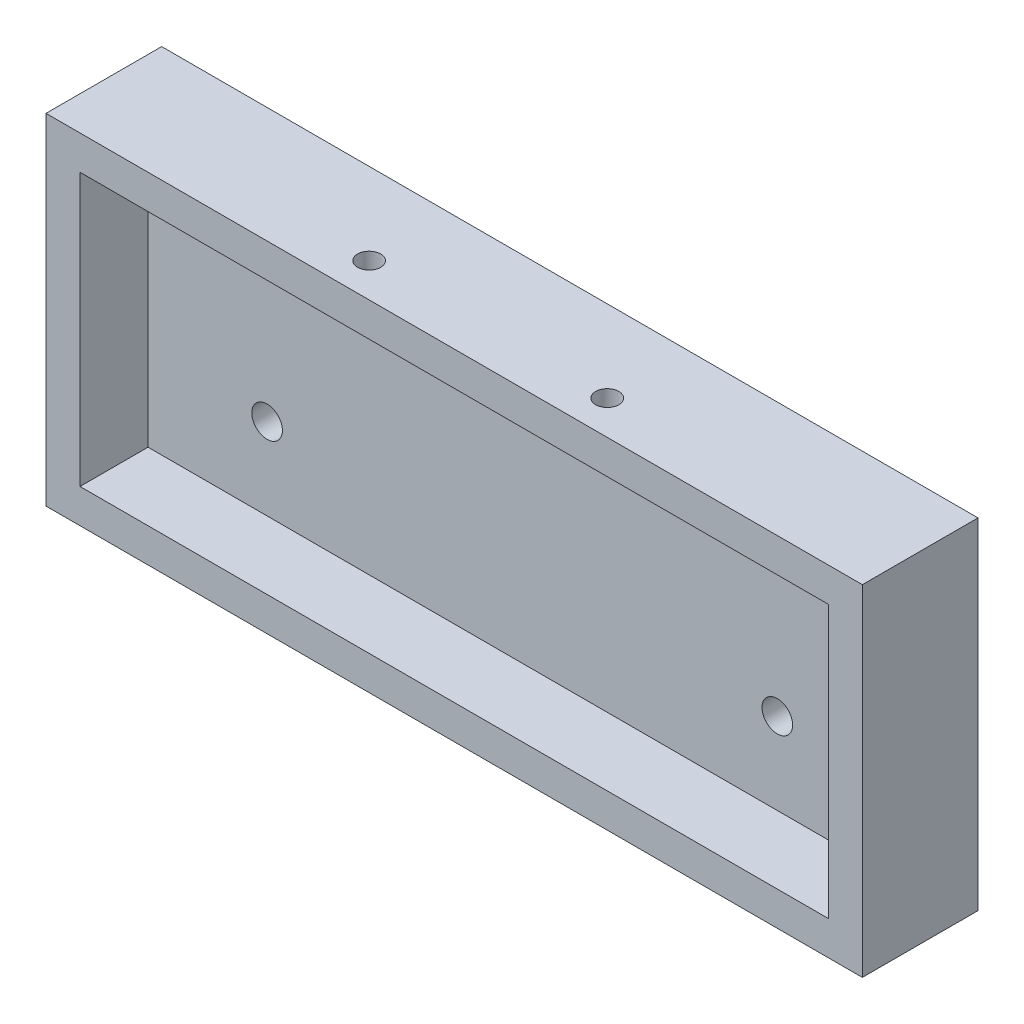
ISO-10303-21;
HEADER;
FILE_DESCRIPTION(('STEP AP214'),'2;1');
FILE_NAME('part.step','',(''),(''),'','','');
FILE_SCHEMA(('AUTOMOTIVE_DESIGN { 1 0 10303 214 1 1 1 1 }'));
ENDSEC;
DATA;
#1=APPLICATION_CONTEXT('core data for automotive mechanical design processes');
#2=APPLICATION_PROTOCOL_DEFINITION('international standard','automotive_design',2000,#1);
#3=PRODUCT_CONTEXT('',#1,'mechanical');
#4=PRODUCT('Part','Part','',(#3));
#5=PRODUCT_RELATED_PRODUCT_CATEGORY('part','',(#4));
#6=PRODUCT_DEFINITION_FORMATION('','',#4);
#7=PRODUCT_DEFINITION_CONTEXT('part definition',#1,'design');
#8=PRODUCT_DEFINITION('design','',#6,#7);
#9=PRODUCT_DEFINITION_SHAPE('','',#8);
#10=(LENGTH_UNIT() NAMED_UNIT(*) SI_UNIT(.MILLI.,.METRE.));
#11=(NAMED_UNIT(*) PLANE_ANGLE_UNIT() SI_UNIT($,.RADIAN.));
#12=(NAMED_UNIT(*) SI_UNIT($,.STERADIAN.) SOLID_ANGLE_UNIT());
#13=UNCERTAINTY_MEASURE_WITH_UNIT(LENGTH_MEASURE(1.E-05),#10,'distance_accuracy_value','');
#14=(GEOMETRIC_REPRESENTATION_CONTEXT(3) GLOBAL_UNCERTAINTY_ASSIGNED_CONTEXT((#13)) GLOBAL_UNIT_ASSIGNED_CONTEXT((#10,
#11,#12)) REPRESENTATION_CONTEXT('',''));
#15=CARTESIAN_POINT('',(0.,0.,0.));
#16=DIRECTION('',(0.,0.,1.));
#17=DIRECTION('',(1.,0.,0.));
#18=AXIS2_PLACEMENT_3D('',#15,#16,#17);
#19=CARTESIAN_POINT('',(0.,0.,17.));
#20=DIRECTION('',(1.,0.,0.));
#21=DIRECTION('',(0.,1.,0.));
#22=AXIS2_PLACEMENT_3D('',#19,#20,#21);
#23=PLANE('',#22);
#24=DIRECTION('',(0.,-1.,0.));
#25=VECTOR('',#24,1.);
#26=CARTESIAN_POINT('',(0.,0.,0.));
#27=LINE('',#26,#25);
#28=CARTESIAN_POINT('',(0.,50.,0.));
#29=VERTEX_POINT('',#28);
#30=CARTESIAN_POINT('',(0.,0.,0.));
#31=VERTEX_POINT('',#30);
#32=EDGE_CURVE('E167',#29,#31,#27,.T.);
#33=ORIENTED_EDGE('',*,*,#32,.T.);
#34=DIRECTION('',(0.,0.,-1.));
#35=VECTOR('',#34,1.);
#36=CARTESIAN_POINT('',(0.,0.,17.));
#37=LINE('',#36,#35);
#38=CARTESIAN_POINT('',(0.,0.,17.));
#39=VERTEX_POINT('',#38);
#40=EDGE_CURVE('E11',#39,#31,#37,.T.);
#41=ORIENTED_EDGE('',*,*,#40,.F.);
#42=DIRECTION('',(0.,-1.,0.));
#43=VECTOR('',#42,1.);
#44=CARTESIAN_POINT('',(0.,0.,17.));
#45=LINE('',#44,#43);
#46=CARTESIAN_POINT('',(0.,50.,17.));
#47=VERTEX_POINT('',#46);
#48=EDGE_CURVE('E173',#47,#39,#45,.T.);
#49=ORIENTED_EDGE('',*,*,#48,.F.);
#50=DIRECTION('',(0.,0.,-1.));
#51=VECTOR('',#50,1.);
#52=CARTESIAN_POINT('',(0.,50.,17.));
#53=LINE('',#52,#51);
#54=EDGE_CURVE('E183',#47,#29,#53,.T.);
#55=ORIENTED_EDGE('',*,*,#54,.T.);
#56=EDGE_LOOP('',(#33,#41,#49,#55));
#57=FACE_BOUND('',#56,.T.);
#58=ADVANCED_FACE('F43',(#57),#23,.F.);
#59=CARTESIAN_POINT('',(0.,0.,17.));
#60=DIRECTION('',(0.,1.,0.));
#61=DIRECTION('',(0.,0.,1.));
#62=AXIS2_PLACEMENT_3D('',#59,#60,#61);
#63=PLANE('',#62);
#64=DIRECTION('',(1.,0.,0.));
#65=VECTOR('',#64,1.);
#66=CARTESIAN_POINT('',(0.,0.,0.));
#67=LINE('',#66,#65);
#68=CARTESIAN_POINT('',(120.,0.,0.));
#69=VERTEX_POINT('',#68);
#70=EDGE_CURVE('E187',#31,#69,#67,.T.);
#71=ORIENTED_EDGE('',*,*,#70,.T.);
#72=DIRECTION('',(0.,0.,-1.));
#73=VECTOR('',#72,1.);
#74=CARTESIAN_POINT('',(120.,0.,17.));
#75=LINE('',#74,#73);
#76=CARTESIAN_POINT('',(120.,0.,17.));
#77=VERTEX_POINT('',#76);
#78=EDGE_CURVE('E52',#77,#69,#75,.T.);
#79=ORIENTED_EDGE('',*,*,#78,.F.);
#80=DIRECTION('',(1.,0.,0.));
#81=VECTOR('',#80,1.);
#82=CARTESIAN_POINT('',(0.,0.,17.));
#83=LINE('',#82,#81);
#84=EDGE_CURVE('E97',#39,#77,#83,.T.);
#85=ORIENTED_EDGE('',*,*,#84,.F.);
#86=ORIENTED_EDGE('',*,*,#40,.T.);
#87=EDGE_LOOP('',(#71,#79,#85,#86));
#88=FACE_BOUND('',#87,.T.);
#89=ADVANCED_FACE('F259',(#88),#63,.F.);
#90=CARTESIAN_POINT('',(120.,0.,17.));
#91=DIRECTION('',(-1.,0.,0.));
#92=DIRECTION('',(0.,-1.,0.));
#93=AXIS2_PLACEMENT_3D('',#90,#91,#92);
#94=PLANE('',#93);
#95=DIRECTION('',(0.,1.,0.));
#96=VECTOR('',#95,1.);
#97=CARTESIAN_POINT('',(120.,0.,0.));
#98=LINE('',#97,#96);
#99=CARTESIAN_POINT('',(120.,50.,0.));
#100=VERTEX_POINT('',#99);
#101=EDGE_CURVE('E190',#69,#100,#98,.T.);
#102=ORIENTED_EDGE('',*,*,#101,.T.);
#103=DIRECTION('',(0.,0.,-1.));
#104=VECTOR('',#103,1.);
#105=CARTESIAN_POINT('',(120.,50.,17.));
#106=LINE('',#105,#104);
#107=CARTESIAN_POINT('',(120.,50.,17.));
#108=VERTEX_POINT('',#107);
#109=EDGE_CURVE('E197',#108,#100,#106,.T.);
#110=ORIENTED_EDGE('',*,*,#109,.F.);
#111=DIRECTION('',(0.,1.,0.));
#112=VECTOR('',#111,1.);
#113=CARTESIAN_POINT('',(120.,0.,17.));
#114=LINE('',#113,#112);
#115=EDGE_CURVE('E178',#77,#108,#114,.T.);
#116=ORIENTED_EDGE('',*,*,#115,.F.);
#117=ORIENTED_EDGE('',*,*,#78,.T.);
#118=EDGE_LOOP('',(#102,#110,#116,#117));
#119=FACE_BOUND('',#118,.T.);
#120=ADVANCED_FACE('F264',(#119),#94,.F.);
#121=CARTESIAN_POINT('',(0.,50.,17.));
#122=DIRECTION('',(0.,-1.,0.));
#123=DIRECTION('',(0.,0.,-1.));
#124=AXIS2_PLACEMENT_3D('',#121,#122,#123);
#125=PLANE('',#124);
#126=CARTESIAN_POINT('',(42.5,50.,12.));
#127=DIRECTION('',(0.,-1.,0.));
#128=DIRECTION('',(0.,0.,-1.));
#129=AXIS2_PLACEMENT_3D('',#126,#127,#128);
#130=CIRCLE('',#129,1.7);
#131=CARTESIAN_POINT('',(42.5,50.,10.3));
#132=VERTEX_POINT('',#131);
#133=EDGE_CURVE('E227',#132,#132,#130,.T.);
#134=ORIENTED_EDGE('',*,*,#133,.T.);
#135=EDGE_LOOP('',(#134));
#136=FACE_BOUND('',#135,.T.);
#137=CARTESIAN_POINT('',(77.5,50.,12.));
#138=DIRECTION('',(0.,-1.,0.));
#139=DIRECTION('',(0.,0.,-1.));
#140=AXIS2_PLACEMENT_3D('',#137,#138,#139);
#141=CIRCLE('',#140,1.69999999999999);
#142=CARTESIAN_POINT('',(77.5,50.,10.3));
#143=VERTEX_POINT('',#142);
#144=EDGE_CURVE('E149',#143,#143,#141,.T.);
#145=ORIENTED_EDGE('',*,*,#144,.T.);
#146=EDGE_LOOP('',(#145));
#147=FACE_BOUND('',#146,.T.);
#148=DIRECTION('',(-1.,0.,0.));
#149=VECTOR('',#148,1.);
#150=CARTESIAN_POINT('',(0.,50.,0.));
#151=LINE('',#150,#149);
#152=EDGE_CURVE('E90',#100,#29,#151,.T.);
#153=ORIENTED_EDGE('',*,*,#152,.T.);
#154=ORIENTED_EDGE('',*,*,#54,.F.);
#155=DIRECTION('',(-1.,0.,0.));
#156=VECTOR('',#155,1.);
#157=CARTESIAN_POINT('',(0.,50.,17.));
#158=LINE('',#157,#156);
#159=EDGE_CURVE('E69',#108,#47,#158,.T.);
#160=ORIENTED_EDGE('',*,*,#159,.F.);
#161=ORIENTED_EDGE('',*,*,#109,.T.);
#162=EDGE_LOOP('',(#153,#154,#160,#161));
#163=FACE_BOUND('',#162,.T.);
#164=ADVANCED_FACE('F243',(#136,#147,#163),#125,.F.);
#165=CARTESIAN_POINT('',(0.,0.,17.));
#166=DIRECTION('',(0.,0.,-1.));
#167=DIRECTION('',(-1.,0.,0.));
#168=AXIS2_PLACEMENT_3D('',#165,#166,#167);
#169=PLANE('',#168);
#170=DIRECTION('',(1.,0.,0.));
#171=VECTOR('',#170,1.);
#172=CARTESIAN_POINT('',(4.99999999999998,5.,17.));
#173=LINE('',#172,#171);
#174=CARTESIAN_POINT('',(4.99999999999998,5.,17.));
#175=VERTEX_POINT('',#174);
#176=CARTESIAN_POINT('',(115.,5.,17.));
#177=VERTEX_POINT('',#176);
#178=EDGE_CURVE('E158',#175,#177,#173,.T.);
#179=ORIENTED_EDGE('',*,*,#178,.F.);
#180=DIRECTION('',(0.,-1.,0.));
#181=VECTOR('',#180,1.);
#182=CARTESIAN_POINT('',(4.99999999999997,45.,17.));
#183=LINE('',#182,#181);
#184=CARTESIAN_POINT('',(4.99999999999997,45.,17.));
#185=VERTEX_POINT('',#184);
#186=EDGE_CURVE('E60',#185,#175,#183,.T.);
#187=ORIENTED_EDGE('',*,*,#186,.F.);
#188=DIRECTION('',(-1.,0.,0.));
#189=VECTOR('',#188,1.);
#190=CARTESIAN_POINT('',(4.99999999999997,45.,17.));
#191=LINE('',#190,#189);
#192=CARTESIAN_POINT('',(115.,45.,17.));
#193=VERTEX_POINT('',#192);
#194=EDGE_CURVE('E142',#193,#185,#191,.T.);
#195=ORIENTED_EDGE('',*,*,#194,.F.);
#196=DIRECTION('',(0.,1.,0.));
#197=VECTOR('',#196,1.);
#198=CARTESIAN_POINT('',(115.,45.,17.));
#199=LINE('',#198,#197);
#200=EDGE_CURVE('E146',#177,#193,#199,.T.);
#201=ORIENTED_EDGE('',*,*,#200,.F.);
#202=EDGE_LOOP('',(#179,#187,#195,#201));
#203=FACE_BOUND('',#202,.T.);
#204=ORIENTED_EDGE('',*,*,#48,.T.);
#205=ORIENTED_EDGE('',*,*,#84,.T.);
#206=ORIENTED_EDGE('',*,*,#115,.T.);
#207=ORIENTED_EDGE('',*,*,#159,.T.);
#208=EDGE_LOOP('',(#204,#205,#206,#207));
#209=FACE_BOUND('',#208,.T.);
#210=ADVANCED_FACE('F274',(#203,#209),#169,.F.);
#211=CARTESIAN_POINT('',(0.,0.,0.));
#212=DIRECTION('',(0.,0.,-1.));
#213=DIRECTION('',(-1.,0.,0.));
#214=AXIS2_PLACEMENT_3D('',#211,#212,#213);
#215=PLANE('',#214);
#216=CARTESIAN_POINT('',(97.5,17.,0.));
#217=DIRECTION('',(0.,0.,-1.));
#218=DIRECTION('',(-1.,0.,0.));
#219=AXIS2_PLACEMENT_3D('',#216,#217,#218);
#220=CIRCLE('',#219,4.7);
#221=CARTESIAN_POINT('',(92.8,17.,0.));
#222=VERTEX_POINT('',#221);
#223=EDGE_CURVE('E477',#222,#222,#220,.T.);
#224=ORIENTED_EDGE('',*,*,#223,.F.);
#225=EDGE_LOOP('',(#224));
#226=FACE_BOUND('',#225,.T.);
#227=CARTESIAN_POINT('',(22.5,17.,0.));
#228=DIRECTION('',(0.,0.,-1.));
#229=DIRECTION('',(-1.,0.,0.));
#230=AXIS2_PLACEMENT_3D('',#227,#228,#229);
#231=CIRCLE('',#230,4.7);
#232=CARTESIAN_POINT('',(17.8,17.,0.));
#233=VERTEX_POINT('',#232);
#234=EDGE_CURVE('E215',#233,#233,#231,.T.);
#235=ORIENTED_EDGE('',*,*,#234,.F.);
#236=EDGE_LOOP('',(#235));
#237=FACE_BOUND('',#236,.T.);
#238=ORIENTED_EDGE('',*,*,#32,.F.);
#239=ORIENTED_EDGE('',*,*,#152,.F.);
#240=ORIENTED_EDGE('',*,*,#101,.F.);
#241=ORIENTED_EDGE('',*,*,#70,.F.);
#242=EDGE_LOOP('',(#238,#239,#240,#241));
#243=FACE_BOUND('',#242,.T.);
#244=ADVANCED_FACE('F269',(#226,#237,#243),#215,.T.);
#245=CARTESIAN_POINT('',(4.99999999999997,45.,7.));
#246=DIRECTION('',(-1.,0.,0.));
#247=DIRECTION('',(0.,-1.,0.));
#248=AXIS2_PLACEMENT_3D('',#245,#246,#247);
#249=PLANE('',#248);
#250=ORIENTED_EDGE('',*,*,#186,.T.);
#251=DIRECTION('',(0.,0.,1.));
#252=VECTOR('',#251,1.);
#253=CARTESIAN_POINT('',(4.99999999999998,5.,7.));
#254=LINE('',#253,#252);
#255=CARTESIAN_POINT('',(4.99999999999998,5.,7.));
#256=VERTEX_POINT('',#255);
#257=EDGE_CURVE('E117',#256,#175,#254,.T.);
#258=ORIENTED_EDGE('',*,*,#257,.F.);
#259=DIRECTION('',(0.,-1.,0.));
#260=VECTOR('',#259,1.);
#261=CARTESIAN_POINT('',(4.99999999999997,45.,7.));
#262=LINE('',#261,#260);
#263=CARTESIAN_POINT('',(4.99999999999997,45.,7.));
#264=VERTEX_POINT('',#263);
#265=EDGE_CURVE('E121',#264,#256,#262,.T.);
#266=ORIENTED_EDGE('',*,*,#265,.F.);
#267=DIRECTION('',(0.,0.,1.));
#268=VECTOR('',#267,1.);
#269=CARTESIAN_POINT('',(4.99999999999997,45.,7.));
#270=LINE('',#269,#268);
#271=EDGE_CURVE('E164',#264,#185,#270,.T.);
#272=ORIENTED_EDGE('',*,*,#271,.T.);
#273=EDGE_LOOP('',(#250,#258,#266,#272));
#274=FACE_BOUND('',#273,.T.);
#275=ADVANCED_FACE('F119',(#274),#249,.F.);
#276=CARTESIAN_POINT('',(4.99999999999997,45.,7.));
#277=DIRECTION('',(0.,1.,0.));
#278=DIRECTION('',(0.,0.,1.));
#279=AXIS2_PLACEMENT_3D('',#276,#277,#278);
#280=PLANE('',#279);
#281=CARTESIAN_POINT('',(42.5,45.,12.));
#282=DIRECTION('',(0.,-1.,0.));
#283=DIRECTION('',(0.,0.,-1.));
#284=AXIS2_PLACEMENT_3D('',#281,#282,#283);
#285=CIRCLE('',#284,3.15);
#286=CARTESIAN_POINT('',(42.5,45.,8.85));
#287=VERTEX_POINT('',#286);
#288=EDGE_CURVE('E205',#287,#287,#285,.T.);
#289=ORIENTED_EDGE('',*,*,#288,.F.);
#290=EDGE_LOOP('',(#289));
#291=FACE_BOUND('',#290,.T.);
#292=CARTESIAN_POINT('',(77.5,45.,12.));
#293=DIRECTION('',(0.,-1.,0.));
#294=DIRECTION('',(0.,0.,-1.));
#295=AXIS2_PLACEMENT_3D('',#292,#293,#294);
#296=CIRCLE('',#295,3.15);
#297=CARTESIAN_POINT('',(77.5,45.,8.85));
#298=VERTEX_POINT('',#297);
#299=EDGE_CURVE('E231',#298,#298,#296,.T.);
#300=ORIENTED_EDGE('',*,*,#299,.F.);
#301=EDGE_LOOP('',(#300));
#302=FACE_BOUND('',#301,.T.);
#303=ORIENTED_EDGE('',*,*,#194,.T.);
#304=ORIENTED_EDGE('',*,*,#271,.F.);
#305=DIRECTION('',(-1.,0.,0.));
#306=VECTOR('',#305,1.);
#307=CARTESIAN_POINT('',(4.99999999999997,45.,7.));
#308=LINE('',#307,#306);
#309=CARTESIAN_POINT('',(115.,45.,7.));
#310=VERTEX_POINT('',#309);
#311=EDGE_CURVE('E128',#310,#264,#308,.T.);
#312=ORIENTED_EDGE('',*,*,#311,.F.);
#313=DIRECTION('',(0.,0.,1.));
#314=VECTOR('',#313,1.);
#315=CARTESIAN_POINT('',(115.,45.,7.));
#316=LINE('',#315,#314);
#317=EDGE_CURVE('E168',#310,#193,#316,.T.);
#318=ORIENTED_EDGE('',*,*,#317,.T.);
#319=EDGE_LOOP('',(#303,#304,#312,#318));
#320=FACE_BOUND('',#319,.T.);
#321=ADVANCED_FACE('F310',(#291,#302,#320),#280,.F.);
#322=CARTESIAN_POINT('',(115.,45.,7.));
#323=DIRECTION('',(1.,0.,0.));
#324=DIRECTION('',(0.,0.,-1.));
#325=AXIS2_PLACEMENT_3D('',#322,#323,#324);
#326=PLANE('',#325);
#327=ORIENTED_EDGE('',*,*,#200,.T.);
#328=ORIENTED_EDGE('',*,*,#317,.F.);
#329=DIRECTION('',(0.,1.,0.));
#330=VECTOR('',#329,1.);
#331=CARTESIAN_POINT('',(115.,45.,7.));
#332=LINE('',#331,#330);
#333=CARTESIAN_POINT('',(115.,5.,7.));
#334=VERTEX_POINT('',#333);
#335=EDGE_CURVE('E137',#334,#310,#332,.T.);
#336=ORIENTED_EDGE('',*,*,#335,.F.);
#337=DIRECTION('',(0.,0.,1.));
#338=VECTOR('',#337,1.);
#339=CARTESIAN_POINT('',(115.,5.,7.));
#340=LINE('',#339,#338);
#341=EDGE_CURVE('E127',#334,#177,#340,.T.);
#342=ORIENTED_EDGE('',*,*,#341,.T.);
#343=EDGE_LOOP('',(#327,#328,#336,#342));
#344=FACE_BOUND('',#343,.T.);
#345=ADVANCED_FACE('F314',(#344),#326,.F.);
#346=CARTESIAN_POINT('',(4.99999999999998,5.,7.));
#347=DIRECTION('',(0.,-1.,0.));
#348=DIRECTION('',(0.,0.,-1.));
#349=AXIS2_PLACEMENT_3D('',#346,#347,#348);
#350=PLANE('',#349);
#351=ORIENTED_EDGE('',*,*,#178,.T.);
#352=ORIENTED_EDGE('',*,*,#341,.F.);
#353=DIRECTION('',(1.,0.,0.));
#354=VECTOR('',#353,1.);
#355=CARTESIAN_POINT('',(4.99999999999998,5.,7.));
#356=LINE('',#355,#354);
#357=EDGE_CURVE('E131',#256,#334,#356,.T.);
#358=ORIENTED_EDGE('',*,*,#357,.F.);
#359=ORIENTED_EDGE('',*,*,#257,.T.);
#360=EDGE_LOOP('',(#351,#352,#358,#359));
#361=FACE_BOUND('',#360,.T.);
#362=ADVANCED_FACE('F132',(#361),#350,.F.);
#363=CARTESIAN_POINT('',(0.,0.,7.));
#364=DIRECTION('',(0.,0.,1.));
#365=DIRECTION('',(1.,0.,0.));
#366=AXIS2_PLACEMENT_3D('',#363,#364,#365);
#367=PLANE('',#366);
#368=CARTESIAN_POINT('',(97.5,17.,7.));
#369=DIRECTION('',(0.,0.,1.));
#370=DIRECTION('',(1.,0.,0.));
#371=AXIS2_PLACEMENT_3D('',#368,#369,#370);
#372=CIRCLE('',#371,2.25);
#373=CARTESIAN_POINT('',(99.75,17.,7.));
#374=VERTEX_POINT('',#373);
#375=EDGE_CURVE('E46',#374,#374,#372,.T.);
#376=ORIENTED_EDGE('',*,*,#375,.F.);
#377=EDGE_LOOP('',(#376));
#378=FACE_BOUND('',#377,.T.);
#379=CARTESIAN_POINT('',(22.5,17.,7.));
#380=DIRECTION('',(0.,0.,1.));
#381=DIRECTION('',(1.,0.,0.));
#382=AXIS2_PLACEMENT_3D('',#379,#380,#381);
#383=CIRCLE('',#382,2.25);
#384=CARTESIAN_POINT('',(24.75,17.,7.));
#385=VERTEX_POINT('',#384);
#386=EDGE_CURVE('E202',#385,#385,#383,.T.);
#387=ORIENTED_EDGE('',*,*,#386,.F.);
#388=EDGE_LOOP('',(#387));
#389=FACE_BOUND('',#388,.T.);
#390=ORIENTED_EDGE('',*,*,#265,.T.);
#391=ORIENTED_EDGE('',*,*,#357,.T.);
#392=ORIENTED_EDGE('',*,*,#335,.T.);
#393=ORIENTED_EDGE('',*,*,#311,.T.);
#394=EDGE_LOOP('',(#390,#391,#392,#393));
#395=FACE_BOUND('',#394,.T.);
#396=ADVANCED_FACE('F139',(#378,#389,#395),#367,.T.);
#397=CARTESIAN_POINT('',(77.5,45.,12.));
#398=DIRECTION('',(0.,-1.,0.));
#399=DIRECTION('',(0.,0.,-1.));
#400=AXIS2_PLACEMENT_3D('',#397,#398,#399);
#401=CYLINDRICAL_SURFACE('',#400,1.69999999999999);
#402=ORIENTED_EDGE('',*,*,#144,.F.);
#403=EDGE_LOOP('',(#402));
#404=FACE_BOUND('',#403,.T.);
#405=CARTESIAN_POINT('',(77.5,46.45,12.));
#406=DIRECTION('',(0.,-1.,0.));
#407=DIRECTION('',(0.,0.,-1.));
#408=AXIS2_PLACEMENT_3D('',#405,#406,#407);
#409=CIRCLE('',#408,1.69999999999999);
#410=CARTESIAN_POINT('',(77.5,46.45,10.3));
#411=VERTEX_POINT('',#410);
#412=EDGE_CURVE('E234',#411,#411,#409,.T.);
#413=ORIENTED_EDGE('',*,*,#412,.T.);
#414=EDGE_LOOP('',(#413));
#415=FACE_BOUND('',#414,.T.);
#416=ADVANCED_FACE('F245',(#404,#415),#401,.F.);
#417=CARTESIAN_POINT('',(77.5,45.,12.));
#418=DIRECTION('',(0.,-1.,0.));
#419=DIRECTION('',(0.,0.,-1.));
#420=AXIS2_PLACEMENT_3D('',#417,#418,#419);
#421=CONICAL_SURFACE('',#420,3.15,0.785398163397451);
#422=ORIENTED_EDGE('',*,*,#412,.F.);
#423=EDGE_LOOP('',(#422));
#424=FACE_BOUND('',#423,.T.);
#425=ORIENTED_EDGE('',*,*,#299,.T.);
#426=EDGE_LOOP('',(#425));
#427=FACE_BOUND('',#426,.T.);
#428=ADVANCED_FACE('F247',(#424,#427),#421,.F.);
#429=CARTESIAN_POINT('',(42.5,45.,12.));
#430=DIRECTION('',(0.,-1.,0.));
#431=DIRECTION('',(0.,0.,-1.));
#432=AXIS2_PLACEMENT_3D('',#429,#430,#431);
#433=CYLINDRICAL_SURFACE('',#432,1.7);
#434=ORIENTED_EDGE('',*,*,#133,.F.);
#435=EDGE_LOOP('',(#434));
#436=FACE_BOUND('',#435,.T.);
#437=CARTESIAN_POINT('',(42.5,46.45,12.));
#438=DIRECTION('',(0.,-1.,0.));
#439=DIRECTION('',(0.,0.,-1.));
#440=AXIS2_PLACEMENT_3D('',#437,#438,#439);
#441=CIRCLE('',#440,1.7);
#442=CARTESIAN_POINT('',(42.5,46.45,10.3));
#443=VERTEX_POINT('',#442);
#444=EDGE_CURVE('E212',#443,#443,#441,.T.);
#445=ORIENTED_EDGE('',*,*,#444,.T.);
#446=EDGE_LOOP('',(#445));
#447=FACE_BOUND('',#446,.T.);
#448=ADVANCED_FACE('F253',(#436,#447),#433,.F.);
#449=CARTESIAN_POINT('',(42.5,45.,12.));
#450=DIRECTION('',(0.,-1.,0.));
#451=DIRECTION('',(0.,0.,-1.));
#452=AXIS2_PLACEMENT_3D('',#449,#450,#451);
#453=CONICAL_SURFACE('',#452,3.15,0.785398163397448);
#454=ORIENTED_EDGE('',*,*,#444,.F.);
#455=EDGE_LOOP('',(#454));
#456=FACE_BOUND('',#455,.T.);
#457=ORIENTED_EDGE('',*,*,#288,.T.);
#458=EDGE_LOOP('',(#457));
#459=FACE_BOUND('',#458,.T.);
#460=ADVANCED_FACE('F343',(#456,#459),#453,.F.);
#461=CARTESIAN_POINT('',(22.5,17.,0.));
#462=DIRECTION('',(0.,0.,-1.));
#463=DIRECTION('',(-1.,0.,0.));
#464=AXIS2_PLACEMENT_3D('',#461,#462,#463);
#465=CYLINDRICAL_SURFACE('',#464,2.25);
#466=ORIENTED_EDGE('',*,*,#386,.T.);
#467=EDGE_LOOP('',(#466));
#468=FACE_BOUND('',#467,.T.);
#469=CARTESIAN_POINT('',(22.5,17.,2.45));
#470=DIRECTION('',(0.,0.,-1.));
#471=DIRECTION('',(-1.,0.,0.));
#472=AXIS2_PLACEMENT_3D('',#469,#470,#471);
#473=CIRCLE('',#472,2.25);
#474=CARTESIAN_POINT('',(20.25,17.,2.45));
#475=VERTEX_POINT('',#474);
#476=EDGE_CURVE('E206',#475,#475,#473,.T.);
#477=ORIENTED_EDGE('',*,*,#476,.T.);
#478=EDGE_LOOP('',(#477));
#479=FACE_BOUND('',#478,.T.);
#480=ADVANCED_FACE('F354',(#468,#479),#465,.F.);
#481=CARTESIAN_POINT('',(22.5,17.,0.));
#482=DIRECTION('',(0.,0.,-1.));
#483=DIRECTION('',(-1.,0.,0.));
#484=AXIS2_PLACEMENT_3D('',#481,#482,#483);
#485=CONICAL_SURFACE('',#484,4.7,0.785398163397449);
#486=ORIENTED_EDGE('',*,*,#476,.F.);
#487=EDGE_LOOP('',(#486));
#488=FACE_BOUND('',#487,.T.);
#489=ORIENTED_EDGE('',*,*,#234,.T.);
#490=EDGE_LOOP('',(#489));
#491=FACE_BOUND('',#490,.T.);
#492=ADVANCED_FACE('F378',(#488,#491),#485,.F.);
#493=CARTESIAN_POINT('',(97.5,17.,0.));
#494=DIRECTION('',(0.,0.,-1.));
#495=DIRECTION('',(-1.,0.,0.));
#496=AXIS2_PLACEMENT_3D('',#493,#494,#495);
#497=CYLINDRICAL_SURFACE('',#496,2.25);
#498=ORIENTED_EDGE('',*,*,#375,.T.);
#499=EDGE_LOOP('',(#498));
#500=FACE_BOUND('',#499,.T.);
#501=CARTESIAN_POINT('',(97.5,17.,2.45));
#502=DIRECTION('',(0.,0.,-1.));
#503=DIRECTION('',(-1.,0.,0.));
#504=AXIS2_PLACEMENT_3D('',#501,#502,#503);
#505=CIRCLE('',#504,2.25);
#506=CARTESIAN_POINT('',(95.25,17.,2.45));
#507=VERTEX_POINT('',#506);
#508=EDGE_CURVE('E474',#507,#507,#505,.T.);
#509=ORIENTED_EDGE('',*,*,#508,.T.);
#510=EDGE_LOOP('',(#509));
#511=FACE_BOUND('',#510,.T.);
#512=ADVANCED_FACE('F388',(#500,#511),#497,.F.);
#513=CARTESIAN_POINT('',(97.5,17.,0.));
#514=DIRECTION('',(0.,0.,-1.));
#515=DIRECTION('',(-1.,0.,0.));
#516=AXIS2_PLACEMENT_3D('',#513,#514,#515);
#517=CONICAL_SURFACE('',#516,4.7,0.785398163397447);
#518=ORIENTED_EDGE('',*,*,#508,.F.);
#519=EDGE_LOOP('',(#518));
#520=FACE_BOUND('',#519,.T.);
#521=ORIENTED_EDGE('',*,*,#223,.T.);
#522=EDGE_LOOP('',(#521));
#523=FACE_BOUND('',#522,.T.);
#524=ADVANCED_FACE('F399',(#520,#523),#517,.F.);
#525=CLOSED_SHELL('',(#58,#89,#120,#164,#210,#244,#275,#321,#345,#362,#396,#416,#428,#448,#460,
#480,#492,#512,#524));
#526=MANIFOLD_SOLID_BREP('B2',#525);
#527=ADVANCED_BREP_SHAPE_REPRESENTATION('',(#18,#526),#14);
#528=SHAPE_DEFINITION_REPRESENTATION(#9,#527);
ENDSEC;
END-ISO-10303-21;
